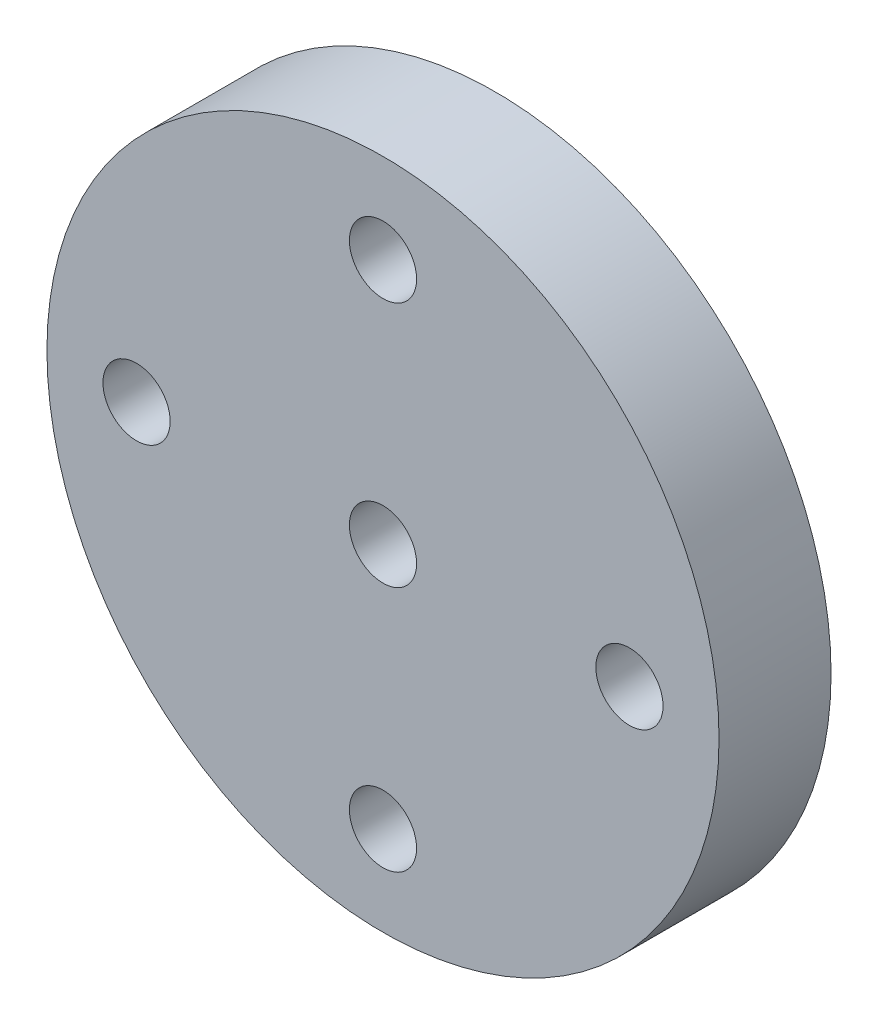
ISO-10303-21;
HEADER;
FILE_DESCRIPTION(('STEP AP214'),'2;1');
FILE_NAME('part.step','',(''),(''),'','','');
FILE_SCHEMA(('AUTOMOTIVE_DESIGN { 1 0 10303 214 1 1 1 1 }'));
ENDSEC;
DATA;
#1=APPLICATION_CONTEXT('core data for automotive mechanical design processes');
#2=APPLICATION_PROTOCOL_DEFINITION('international standard','automotive_design',2000,#1);
#3=PRODUCT_CONTEXT('',#1,'mechanical');
#4=PRODUCT('Part','Part','',(#3));
#5=PRODUCT_RELATED_PRODUCT_CATEGORY('part','',(#4));
#6=PRODUCT_DEFINITION_FORMATION('','',#4);
#7=PRODUCT_DEFINITION_CONTEXT('part definition',#1,'design');
#8=PRODUCT_DEFINITION('design','',#6,#7);
#9=PRODUCT_DEFINITION_SHAPE('','',#8);
#10=(LENGTH_UNIT() NAMED_UNIT(*) SI_UNIT(.MILLI.,.METRE.));
#11=(NAMED_UNIT(*) PLANE_ANGLE_UNIT() SI_UNIT($,.RADIAN.));
#12=(NAMED_UNIT(*) SI_UNIT($,.STERADIAN.) SOLID_ANGLE_UNIT());
#13=UNCERTAINTY_MEASURE_WITH_UNIT(LENGTH_MEASURE(1.E-05),#10,'distance_accuracy_value','');
#14=(GEOMETRIC_REPRESENTATION_CONTEXT(3) GLOBAL_UNCERTAINTY_ASSIGNED_CONTEXT((#13)) GLOBAL_UNIT_ASSIGNED_CONTEXT((#10,
#11,#12)) REPRESENTATION_CONTEXT('',''));
#15=CARTESIAN_POINT('',(0.,0.,0.));
#16=DIRECTION('',(0.,0.,1.));
#17=DIRECTION('',(1.,0.,0.));
#18=AXIS2_PLACEMENT_3D('',#15,#16,#17);
#19=CARTESIAN_POINT('',(2507.64005453112,4716.00292790348,5.));
#20=DIRECTION('',(0.,0.,1.));
#21=DIRECTION('',(1.,0.,0.));
#22=AXIS2_PLACEMENT_3D('',#19,#20,#21);
#23=PLANE('',#22);
#24=CARTESIAN_POINT('',(2496.64005453112,4716.00292790348,5.));
#25=DIRECTION('',(0.,0.,1.));
#26=DIRECTION('',(1.,0.,0.));
#27=AXIS2_PLACEMENT_3D('',#24,#25,#26);
#28=CIRCLE('',#27,1.50000000000006);
#29=CARTESIAN_POINT('',(2498.14005453112,4716.00292790348,5.));
#30=VERTEX_POINT('',#29);
#31=EDGE_CURVE('E61',#30,#30,#28,.T.);
#32=ORIENTED_EDGE('',*,*,#31,.F.);
#33=EDGE_LOOP('',(#32));
#34=FACE_BOUND('',#33,.T.);
#35=CARTESIAN_POINT('',(2507.64005453112,4705.00292790348,5.));
#36=DIRECTION('',(0.,0.,1.));
#37=DIRECTION('',(1.,0.,0.));
#38=AXIS2_PLACEMENT_3D('',#35,#36,#37);
#39=CIRCLE('',#38,1.50000000000006);
#40=CARTESIAN_POINT('',(2509.14005453112,4705.00292790348,5.));
#41=VERTEX_POINT('',#40);
#42=EDGE_CURVE('E49',#41,#41,#39,.T.);
#43=ORIENTED_EDGE('',*,*,#42,.F.);
#44=EDGE_LOOP('',(#43));
#45=FACE_BOUND('',#44,.T.);
#46=CARTESIAN_POINT('',(2507.64005453112,4716.00292790348,5.));
#47=DIRECTION('',(0.,0.,1.));
#48=DIRECTION('',(1.,0.,0.));
#49=AXIS2_PLACEMENT_3D('',#46,#47,#48);
#50=CIRCLE('',#49,15.0000000000001);
#51=CARTESIAN_POINT('',(2522.64005453112,4716.00292790348,5.));
#52=VERTEX_POINT('',#51);
#53=EDGE_CURVE('E10',#52,#52,#50,.T.);
#54=ORIENTED_EDGE('',*,*,#53,.T.);
#55=EDGE_LOOP('',(#54));
#56=FACE_BOUND('',#55,.T.);
#57=CARTESIAN_POINT('',(2507.64005453112,4716.00292790348,5.));
#58=DIRECTION('',(0.,0.,1.));
#59=DIRECTION('',(1.,0.,0.));
#60=AXIS2_PLACEMENT_3D('',#57,#58,#59);
#61=CIRCLE('',#60,1.50000000000006);
#62=CARTESIAN_POINT('',(2509.14005453112,4716.00292790348,5.));
#63=VERTEX_POINT('',#62);
#64=EDGE_CURVE('E44',#63,#63,#61,.T.);
#65=ORIENTED_EDGE('',*,*,#64,.F.);
#66=EDGE_LOOP('',(#65));
#67=FACE_BOUND('',#66,.T.);
#68=CARTESIAN_POINT('',(2507.64005453112,4727.00292790348,5.));
#69=DIRECTION('',(0.,0.,1.));
#70=DIRECTION('',(1.,0.,0.));
#71=AXIS2_PLACEMENT_3D('',#68,#69,#70);
#72=CIRCLE('',#71,1.50000000000006);
#73=CARTESIAN_POINT('',(2509.14005453112,4727.00292790348,5.));
#74=VERTEX_POINT('',#73);
#75=EDGE_CURVE('E55',#74,#74,#72,.T.);
#76=ORIENTED_EDGE('',*,*,#75,.F.);
#77=EDGE_LOOP('',(#76));
#78=FACE_BOUND('',#77,.T.);
#79=CARTESIAN_POINT('',(2518.64005453112,4716.00292790348,5.));
#80=DIRECTION('',(0.,0.,1.));
#81=DIRECTION('',(1.,0.,0.));
#82=AXIS2_PLACEMENT_3D('',#79,#80,#81);
#83=CIRCLE('',#82,1.50000000000006);
#84=CARTESIAN_POINT('',(2520.14005453112,4716.00292790348,5.));
#85=VERTEX_POINT('',#84);
#86=EDGE_CURVE('E67',#85,#85,#83,.T.);
#87=ORIENTED_EDGE('',*,*,#86,.F.);
#88=EDGE_LOOP('',(#87));
#89=FACE_BOUND('',#88,.T.);
#90=ADVANCED_FACE('F33',(#34,#45,#56,#67,#78,#89),#23,.T.);
#91=CARTESIAN_POINT('',(2507.64005453112,4716.00292790348,0.));
#92=DIRECTION('',(0.,0.,1.));
#93=DIRECTION('',(1.,0.,0.));
#94=AXIS2_PLACEMENT_3D('',#91,#92,#93);
#95=PLANE('',#94);
#96=CARTESIAN_POINT('',(2507.64005453112,4716.00292790348,0.));
#97=DIRECTION('',(0.,0.,1.));
#98=DIRECTION('',(1.,0.,0.));
#99=AXIS2_PLACEMENT_3D('',#96,#97,#98);
#100=CIRCLE('',#99,15.0000000000001);
#101=CARTESIAN_POINT('',(2522.64005453112,4716.00292790348,0.));
#102=VERTEX_POINT('',#101);
#103=EDGE_CURVE('E37',#102,#102,#100,.T.);
#104=ORIENTED_EDGE('',*,*,#103,.F.);
#105=EDGE_LOOP('',(#104));
#106=FACE_BOUND('',#105,.T.);
#107=CARTESIAN_POINT('',(2507.64005453112,4716.00292790348,0.));
#108=DIRECTION('',(0.,0.,1.));
#109=DIRECTION('',(1.,0.,0.));
#110=AXIS2_PLACEMENT_3D('',#107,#108,#109);
#111=CIRCLE('',#110,1.50000000000006);
#112=CARTESIAN_POINT('',(2509.14005453112,4716.00292790348,0.));
#113=VERTEX_POINT('',#112);
#114=EDGE_CURVE('E46',#113,#113,#111,.T.);
#115=ORIENTED_EDGE('',*,*,#114,.T.);
#116=EDGE_LOOP('',(#115));
#117=FACE_BOUND('',#116,.T.);
#118=CARTESIAN_POINT('',(2507.64005453112,4705.00292790348,0.));
#119=DIRECTION('',(0.,0.,1.));
#120=DIRECTION('',(1.,0.,0.));
#121=AXIS2_PLACEMENT_3D('',#118,#119,#120);
#122=CIRCLE('',#121,1.50000000000006);
#123=CARTESIAN_POINT('',(2509.14005453112,4705.00292790348,0.));
#124=VERTEX_POINT('',#123);
#125=EDGE_CURVE('E52',#124,#124,#122,.T.);
#126=ORIENTED_EDGE('',*,*,#125,.T.);
#127=EDGE_LOOP('',(#126));
#128=FACE_BOUND('',#127,.T.);
#129=CARTESIAN_POINT('',(2507.64005453112,4727.00292790348,0.));
#130=DIRECTION('',(0.,0.,1.));
#131=DIRECTION('',(1.,0.,0.));
#132=AXIS2_PLACEMENT_3D('',#129,#130,#131);
#133=CIRCLE('',#132,1.50000000000006);
#134=CARTESIAN_POINT('',(2509.14005453112,4727.00292790348,0.));
#135=VERTEX_POINT('',#134);
#136=EDGE_CURVE('E58',#135,#135,#133,.T.);
#137=ORIENTED_EDGE('',*,*,#136,.T.);
#138=EDGE_LOOP('',(#137));
#139=FACE_BOUND('',#138,.T.);
#140=CARTESIAN_POINT('',(2496.64005453112,4716.00292790348,0.));
#141=DIRECTION('',(0.,0.,1.));
#142=DIRECTION('',(1.,0.,0.));
#143=AXIS2_PLACEMENT_3D('',#140,#141,#142);
#144=CIRCLE('',#143,1.50000000000006);
#145=CARTESIAN_POINT('',(2498.14005453112,4716.00292790348,0.));
#146=VERTEX_POINT('',#145);
#147=EDGE_CURVE('E64',#146,#146,#144,.T.);
#148=ORIENTED_EDGE('',*,*,#147,.T.);
#149=EDGE_LOOP('',(#148));
#150=FACE_BOUND('',#149,.T.);
#151=CARTESIAN_POINT('',(2518.64005453112,4716.00292790348,0.));
#152=DIRECTION('',(0.,0.,1.));
#153=DIRECTION('',(1.,0.,0.));
#154=AXIS2_PLACEMENT_3D('',#151,#152,#153);
#155=CIRCLE('',#154,1.50000000000006);
#156=CARTESIAN_POINT('',(2520.14005453112,4716.00292790348,0.));
#157=VERTEX_POINT('',#156);
#158=EDGE_CURVE('E70',#157,#157,#155,.T.);
#159=ORIENTED_EDGE('',*,*,#158,.T.);
#160=EDGE_LOOP('',(#159));
#161=FACE_BOUND('',#160,.T.);
#162=ADVANCED_FACE('F80',(#106,#117,#128,#139,#150,#161),#95,.F.);
#163=CARTESIAN_POINT('',(2507.64005453112,4716.00292790348,5.));
#164=DIRECTION('',(0.,0.,-1.));
#165=DIRECTION('',(-1.,0.,0.));
#166=AXIS2_PLACEMENT_3D('',#163,#164,#165);
#167=CYLINDRICAL_SURFACE('',#166,15.0000000000001);
#168=ORIENTED_EDGE('',*,*,#53,.F.);
#169=EDGE_LOOP('',(#168));
#170=FACE_BOUND('',#169,.T.);
#171=ORIENTED_EDGE('',*,*,#103,.T.);
#172=EDGE_LOOP('',(#171));
#173=FACE_BOUND('',#172,.T.);
#174=ADVANCED_FACE('F35',(#170,#173),#167,.T.);
#175=CARTESIAN_POINT('',(2507.64005453112,4716.00292790348,5.));
#176=DIRECTION('',(0.,0.,-1.));
#177=DIRECTION('',(-1.,0.,0.));
#178=AXIS2_PLACEMENT_3D('',#175,#176,#177);
#179=CYLINDRICAL_SURFACE('',#178,1.50000000000006);
#180=ORIENTED_EDGE('',*,*,#64,.T.);
#181=EDGE_LOOP('',(#180));
#182=FACE_BOUND('',#181,.T.);
#183=ORIENTED_EDGE('',*,*,#114,.F.);
#184=EDGE_LOOP('',(#183));
#185=FACE_BOUND('',#184,.T.);
#186=ADVANCED_FACE('F90',(#182,#185),#179,.F.);
#187=CARTESIAN_POINT('',(2507.64005453112,4705.00292790348,5.));
#188=DIRECTION('',(0.,0.,-1.));
#189=DIRECTION('',(-1.,0.,0.));
#190=AXIS2_PLACEMENT_3D('',#187,#188,#189);
#191=CYLINDRICAL_SURFACE('',#190,1.50000000000006);
#192=ORIENTED_EDGE('',*,*,#42,.T.);
#193=EDGE_LOOP('',(#192));
#194=FACE_BOUND('',#193,.T.);
#195=ORIENTED_EDGE('',*,*,#125,.F.);
#196=EDGE_LOOP('',(#195));
#197=FACE_BOUND('',#196,.T.);
#198=ADVANCED_FACE('F93',(#194,#197),#191,.F.);
#199=CARTESIAN_POINT('',(2507.64005453112,4727.00292790348,5.));
#200=DIRECTION('',(0.,0.,-1.));
#201=DIRECTION('',(-1.,0.,0.));
#202=AXIS2_PLACEMENT_3D('',#199,#200,#201);
#203=CYLINDRICAL_SURFACE('',#202,1.50000000000006);
#204=ORIENTED_EDGE('',*,*,#75,.T.);
#205=EDGE_LOOP('',(#204));
#206=FACE_BOUND('',#205,.T.);
#207=ORIENTED_EDGE('',*,*,#136,.F.);
#208=EDGE_LOOP('',(#207));
#209=FACE_BOUND('',#208,.T.);
#210=ADVANCED_FACE('F97',(#206,#209),#203,.F.);
#211=CARTESIAN_POINT('',(2496.64005453112,4716.00292790348,5.));
#212=DIRECTION('',(0.,0.,-1.));
#213=DIRECTION('',(-1.,0.,0.));
#214=AXIS2_PLACEMENT_3D('',#211,#212,#213);
#215=CYLINDRICAL_SURFACE('',#214,1.50000000000006);
#216=ORIENTED_EDGE('',*,*,#31,.T.);
#217=EDGE_LOOP('',(#216));
#218=FACE_BOUND('',#217,.T.);
#219=ORIENTED_EDGE('',*,*,#147,.F.);
#220=EDGE_LOOP('',(#219));
#221=FACE_BOUND('',#220,.T.);
#222=ADVANCED_FACE('F101',(#218,#221),#215,.F.);
#223=CARTESIAN_POINT('',(2518.64005453112,4716.00292790348,5.));
#224=DIRECTION('',(0.,0.,-1.));
#225=DIRECTION('',(-1.,0.,0.));
#226=AXIS2_PLACEMENT_3D('',#223,#224,#225);
#227=CYLINDRICAL_SURFACE('',#226,1.50000000000006);
#228=ORIENTED_EDGE('',*,*,#86,.T.);
#229=EDGE_LOOP('',(#228));
#230=FACE_BOUND('',#229,.T.);
#231=ORIENTED_EDGE('',*,*,#158,.F.);
#232=EDGE_LOOP('',(#231));
#233=FACE_BOUND('',#232,.T.);
#234=ADVANCED_FACE('F76',(#230,#233),#227,.F.);
#235=CLOSED_SHELL('',(#90,#162,#174,#186,#198,#210,#222,#234));
#236=MANIFOLD_SOLID_BREP('B2',#235);
#237=ADVANCED_BREP_SHAPE_REPRESENTATION('',(#18,#236),#14);
#238=SHAPE_DEFINITION_REPRESENTATION(#9,#237);
ENDSEC;
END-ISO-10303-21;
